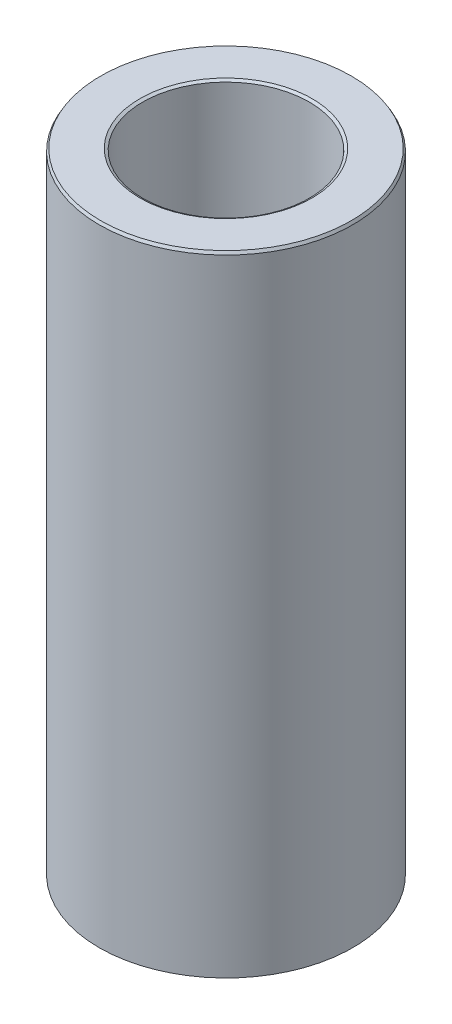
ISO-10303-21;
HEADER;
FILE_DESCRIPTION(('STEP AP214'),'2;1');
FILE_NAME('part.step','',(''),(''),'','','');
FILE_SCHEMA(('AUTOMOTIVE_DESIGN { 1 0 10303 214 1 1 1 1 }'));
ENDSEC;
DATA;
#1=APPLICATION_CONTEXT('core data for automotive mechanical design processes');
#2=APPLICATION_PROTOCOL_DEFINITION('international standard','automotive_design',2000,#1);
#3=PRODUCT_CONTEXT('',#1,'mechanical');
#4=PRODUCT('Part','Part','',(#3));
#5=PRODUCT_RELATED_PRODUCT_CATEGORY('part','',(#4));
#6=PRODUCT_DEFINITION_FORMATION('','',#4);
#7=PRODUCT_DEFINITION_CONTEXT('part definition',#1,'design');
#8=PRODUCT_DEFINITION('design','',#6,#7);
#9=PRODUCT_DEFINITION_SHAPE('','',#8);
#10=(LENGTH_UNIT() NAMED_UNIT(*) SI_UNIT(.MILLI.,.METRE.));
#11=(NAMED_UNIT(*) PLANE_ANGLE_UNIT() SI_UNIT($,.RADIAN.));
#12=(NAMED_UNIT(*) SI_UNIT($,.STERADIAN.) SOLID_ANGLE_UNIT());
#13=UNCERTAINTY_MEASURE_WITH_UNIT(LENGTH_MEASURE(1.E-05),#10,'distance_accuracy_value','');
#14=(GEOMETRIC_REPRESENTATION_CONTEXT(3) GLOBAL_UNCERTAINTY_ASSIGNED_CONTEXT((#13)) GLOBAL_UNIT_ASSIGNED_CONTEXT((#10,
#11,#12)) REPRESENTATION_CONTEXT('',''));
#15=CARTESIAN_POINT('',(0.,0.,0.));
#16=DIRECTION('',(0.,0.,1.));
#17=DIRECTION('',(1.,0.,0.));
#18=AXIS2_PLACEMENT_3D('',#15,#16,#17);
#19=CARTESIAN_POINT('',(0.,74.5081177382595,0.));
#20=DIRECTION('',(0.,-1.,0.));
#21=DIRECTION('',(0.,0.,-1.));
#22=AXIS2_PLACEMENT_3D('',#19,#20,#21);
#23=CYLINDRICAL_SURFACE('',#22,15.);
#24=CARTESIAN_POINT('',(0.,0.187076625269136,0.));
#25=DIRECTION('',(0.,1.,0.));
#26=DIRECTION('',(0.,0.,1.));
#27=AXIS2_PLACEMENT_3D('',#24,#25,#26);
#28=CIRCLE('',#27,15.);
#29=CARTESIAN_POINT('',(0.,0.187076625269136,15.));
#30=VERTEX_POINT('',#29);
#31=EDGE_CURVE('E10',#30,#30,#28,.T.);
#32=ORIENTED_EDGE('',*,*,#31,.T.);
#33=EDGE_LOOP('',(#32));
#34=FACE_BOUND('',#33,.T.);
#35=CARTESIAN_POINT('',(0.,74.1840915183848,0.));
#36=DIRECTION('',(0.,1.,0.));
#37=DIRECTION('',(0.,0.,1.));
#38=AXIS2_PLACEMENT_3D('',#35,#36,#37);
#39=CIRCLE('',#38,15.);
#40=CARTESIAN_POINT('',(0.,74.1840915183848,-15.));
#41=VERTEX_POINT('',#40);
#42=EDGE_CURVE('E50',#41,#41,#39,.F.);
#43=ORIENTED_EDGE('',*,*,#42,.T.);
#44=EDGE_LOOP('',(#43));
#45=FACE_BOUND('',#44,.T.);
#46=ADVANCED_FACE('F39',(#34,#45),#23,.T.);
#47=CARTESIAN_POINT('',(0.,74.5081177382595,0.));
#48=DIRECTION('',(0.,1.,0.));
#49=DIRECTION('',(0.,0.,1.));
#50=AXIS2_PLACEMENT_3D('',#47,#48,#49);
#51=PLANE('',#50);
#52=CARTESIAN_POINT('',(0.,74.5081177382595,0.));
#53=DIRECTION('',(0.,1.,0.));
#54=DIRECTION('',(0.,0.,1.));
#55=AXIS2_PLACEMENT_3D('',#52,#53,#54);
#56=CIRCLE('',#55,10.1763425456597);
#57=CARTESIAN_POINT('',(0.,74.5081177382595,10.1763425456597));
#58=VERTEX_POINT('',#57);
#59=EDGE_CURVE('E58',#58,#58,#56,.F.);
#60=ORIENTED_EDGE('',*,*,#59,.T.);
#61=EDGE_LOOP('',(#60));
#62=FACE_BOUND('',#61,.T.);
#63=CARTESIAN_POINT('',(0.,74.5081177382595,0.));
#64=DIRECTION('',(0.,1.,0.));
#65=DIRECTION('',(0.,0.,1.));
#66=AXIS2_PLACEMENT_3D('',#63,#64,#65);
#67=CIRCLE('',#66,14.8129233747309);
#68=CARTESIAN_POINT('',(0.,74.5081177382595,-14.8129233747309));
#69=VERTEX_POINT('',#68);
#70=EDGE_CURVE('E61',#69,#69,#67,.T.);
#71=ORIENTED_EDGE('',*,*,#70,.T.);
#72=EDGE_LOOP('',(#71));
#73=FACE_BOUND('',#72,.T.);
#74=ADVANCED_FACE('F88',(#62,#73),#51,.T.);
#75=CARTESIAN_POINT('',(0.,0.,0.));
#76=DIRECTION('',(0.,1.,0.));
#77=DIRECTION('',(0.,0.,1.));
#78=AXIS2_PLACEMENT_3D('',#75,#76,#77);
#79=PLANE('',#78);
#80=CARTESIAN_POINT('',(0.,0.,0.));
#81=DIRECTION('',(0.,1.,0.));
#82=DIRECTION('',(0.,0.,1.));
#83=AXIS2_PLACEMENT_3D('',#80,#81,#82);
#84=CIRCLE('',#83,10.0393929510542);
#85=CARTESIAN_POINT('',(0.,0.,10.0393929510542));
#86=VERTEX_POINT('',#85);
#87=EDGE_CURVE('E51',#86,#86,#84,.T.);
#88=ORIENTED_EDGE('',*,*,#87,.T.);
#89=EDGE_LOOP('',(#88));
#90=FACE_BOUND('',#89,.T.);
#91=CARTESIAN_POINT('',(0.,0.,0.));
#92=DIRECTION('',(0.,1.,0.));
#93=DIRECTION('',(0.,0.,1.));
#94=AXIS2_PLACEMENT_3D('',#91,#92,#93);
#95=CIRCLE('',#94,14.6759737801253);
#96=CARTESIAN_POINT('',(0.,0.,14.6759737801253));
#97=VERTEX_POINT('',#96);
#98=EDGE_CURVE('E54',#97,#97,#95,.F.);
#99=ORIENTED_EDGE('',*,*,#98,.T.);
#100=EDGE_LOOP('',(#99));
#101=FACE_BOUND('',#100,.T.);
#102=ADVANCED_FACE('F83',(#90,#101),#79,.F.);
#103=CARTESIAN_POINT('',(0.,74.5081177382595,0.));
#104=DIRECTION('',(0.,-1.,0.));
#105=DIRECTION('',(0.,0.,-1.));
#106=AXIS2_PLACEMENT_3D('',#103,#104,#105);
#107=CYLINDRICAL_SURFACE('',#106,9.85231632578505);
#108=CARTESIAN_POINT('',(0.,74.3210411129904,0.));
#109=DIRECTION('',(0.,1.,0.));
#110=DIRECTION('',(0.,0.,1.));
#111=AXIS2_PLACEMENT_3D('',#108,#109,#110);
#112=CIRCLE('',#111,9.85231632578505);
#113=CARTESIAN_POINT('',(0.,74.3210411129904,9.85231632578505));
#114=VERTEX_POINT('',#113);
#115=EDGE_CURVE('E67',#114,#114,#112,.T.);
#116=ORIENTED_EDGE('',*,*,#115,.T.);
#117=EDGE_LOOP('',(#116));
#118=FACE_BOUND('',#117,.T.);
#119=CARTESIAN_POINT('',(0.,0.324026219874665,0.));
#120=DIRECTION('',(0.,1.,0.));
#121=DIRECTION('',(0.,0.,1.));
#122=AXIS2_PLACEMENT_3D('',#119,#120,#121);
#123=CIRCLE('',#122,9.85231632578505);
#124=CARTESIAN_POINT('',(0.,0.324026219874665,9.85231632578505));
#125=VERTEX_POINT('',#124);
#126=EDGE_CURVE('E69',#125,#125,#123,.F.);
#127=ORIENTED_EDGE('',*,*,#126,.T.);
#128=EDGE_LOOP('',(#127));
#129=FACE_BOUND('',#128,.T.);
#130=ADVANCED_FACE('F71',(#118,#129),#107,.F.);
#131=CARTESIAN_POINT('',(0.,74.3210411129904,0.));
#132=DIRECTION('',(0.,1.,0.));
#133=DIRECTION('',(0.,0.,1.));
#134=AXIS2_PLACEMENT_3D('',#131,#132,#133);
#135=CONICAL_SURFACE('',#134,9.85231632578505,1.04719755119661);
#136=ORIENTED_EDGE('',*,*,#59,.F.);
#137=EDGE_LOOP('',(#136));
#138=FACE_BOUND('',#137,.T.);
#139=ORIENTED_EDGE('',*,*,#115,.F.);
#140=EDGE_LOOP('',(#139));
#141=FACE_BOUND('',#140,.T.);
#142=ADVANCED_FACE('F77',(#138,#141),#135,.F.);
#143=CARTESIAN_POINT('',(0.,0.,0.));
#144=DIRECTION('',(0.,-1.,0.));
#145=DIRECTION('',(0.,0.,-1.));
#146=AXIS2_PLACEMENT_3D('',#143,#144,#145);
#147=CONICAL_SURFACE('',#146,10.0393929510542,0.523598775598286);
#148=ORIENTED_EDGE('',*,*,#126,.F.);
#149=EDGE_LOOP('',(#148));
#150=FACE_BOUND('',#149,.T.);
#151=ORIENTED_EDGE('',*,*,#87,.F.);
#152=EDGE_LOOP('',(#151));
#153=FACE_BOUND('',#152,.T.);
#154=ADVANCED_FACE('F73',(#150,#153),#147,.F.);
#155=CARTESIAN_POINT('',(0.,0.187076625269136,0.));
#156=DIRECTION('',(0.,1.,0.));
#157=DIRECTION('',(0.,0.,1.));
#158=AXIS2_PLACEMENT_3D('',#155,#156,#157);
#159=CONICAL_SURFACE('',#158,15.,1.04719755119658);
#160=ORIENTED_EDGE('',*,*,#98,.F.);
#161=EDGE_LOOP('',(#160));
#162=FACE_BOUND('',#161,.T.);
#163=ORIENTED_EDGE('',*,*,#31,.F.);
#164=EDGE_LOOP('',(#163));
#165=FACE_BOUND('',#164,.T.);
#166=ADVANCED_FACE('F76',(#162,#165),#159,.T.);
#167=CARTESIAN_POINT('',(0.,74.5081177382595,0.));
#168=DIRECTION('',(0.,-1.,0.));
#169=DIRECTION('',(0.,0.,-1.));
#170=AXIS2_PLACEMENT_3D('',#167,#168,#169);
#171=CONICAL_SURFACE('',#170,14.8129233747309,0.523598775598284);
#172=CARTESIAN_POINT('',(0.,74.1840915183848,-15.));
#173=CARTESIAN_POINT('',(0.,74.1874667915085,-14.9980512851534));
#174=CARTESIAN_POINT('',(0.,74.1908420646322,-14.9961025703069));
#175=CARTESIAN_POINT('',(0.,74.1975926108796,-14.9922051406138));
#176=CARTESIAN_POINT('',(0.,74.2009678840033,-14.9902564257672));
#177=CARTESIAN_POINT('',(0.,74.2077184302507,-14.9863589960741));
#178=CARTESIAN_POINT('',(0.,74.2110937033744,-14.9844102812276));
#179=CARTESIAN_POINT('',(0.,74.2178442496217,-14.9805128515345));
#180=CARTESIAN_POINT('',(0.,74.2212195227454,-14.9785641366879));
#181=CARTESIAN_POINT('',(0.,74.2279700689928,-14.9746667069948));
#182=CARTESIAN_POINT('',(0.,74.2313453421165,-14.9727179921483));
#183=CARTESIAN_POINT('',(0.,74.2380958883639,-14.9688205624551));
#184=CARTESIAN_POINT('',(0.,74.2414711614876,-14.9668718476086));
#185=CARTESIAN_POINT('',(0.,74.248221707735,-14.9629744179155));
#186=CARTESIAN_POINT('',(0.,74.2515969808587,-14.9610257030689));
#187=CARTESIAN_POINT('',(0.,74.2583475271061,-14.9571282733758));
#188=CARTESIAN_POINT('',(0.,74.2617228002298,-14.9551795585293));
#189=CARTESIAN_POINT('',(0.,74.2684733464772,-14.9512821288362));
#190=CARTESIAN_POINT('',(0.,74.2718486196009,-14.9493334139896));
#191=CARTESIAN_POINT('',(0.,74.2785991658482,-14.9454359842965));
#192=CARTESIAN_POINT('',(0.,74.281974438972,-14.94348726945));
#193=CARTESIAN_POINT('',(0.,74.2887249852193,-14.9395898397568));
#194=CARTESIAN_POINT('',(0.,74.292100258343,-14.9376411249103));
#195=CARTESIAN_POINT('',(0.,74.2988508045904,-14.9337436952172));
#196=CARTESIAN_POINT('',(0.,74.3022260777141,-14.9317949803706));
#197=CARTESIAN_POINT('',(0.,74.3089766239615,-14.9278975506775));
#198=CARTESIAN_POINT('',(0.,74.3123518970852,-14.925948835831));
#199=CARTESIAN_POINT('',(0.,74.3191024433326,-14.9220514061379));
#200=CARTESIAN_POINT('',(0.,74.3224777164563,-14.9201026912913));
#201=CARTESIAN_POINT('',(0.,74.3292282627037,-14.9162052615982));
#202=CARTESIAN_POINT('',(0.,74.3326035358274,-14.9142565467517));
#203=CARTESIAN_POINT('',(0.,74.3393540820748,-14.9103591170585));
#204=CARTESIAN_POINT('',(0.,74.3427293551984,-14.908410402212));
#205=CARTESIAN_POINT('',(0.,74.3494799014458,-14.9045129725189));
#206=CARTESIAN_POINT('',(0.,74.3528551745695,-14.9025642576723));
#207=CARTESIAN_POINT('',(0.,74.3596057208169,-14.8986668279792));
#208=CARTESIAN_POINT('',(0.,74.3629809939406,-14.8967181131327));
#209=CARTESIAN_POINT('',(0.,74.369731540188,-14.8928206834396));
#210=CARTESIAN_POINT('',(0.,74.3731068133117,-14.890871968593));
#211=CARTESIAN_POINT('',(0.,74.3798573595591,-14.8869745388999));
#212=CARTESIAN_POINT('',(0.,74.3832326326828,-14.8850258240533));
#213=CARTESIAN_POINT('',(0.,74.3899831789302,-14.8811283943602));
#214=CARTESIAN_POINT('',(0.,74.3933584520539,-14.8791796795137));
#215=CARTESIAN_POINT('',(0.,74.4001089983012,-14.8752822498206));
#216=CARTESIAN_POINT('',(0.,74.403484271425,-14.873333534974));
#217=CARTESIAN_POINT('',(0.,74.4102348176723,-14.8694361052809));
#218=CARTESIAN_POINT('',(0.,74.413610090796,-14.8674873904344));
#219=CARTESIAN_POINT('',(0.,74.4203606370434,-14.8635899607413));
#220=CARTESIAN_POINT('',(0.,74.4237359101671,-14.8616412458947));
#221=CARTESIAN_POINT('',(0.,74.4304864564145,-14.8577438162016));
#222=CARTESIAN_POINT('',(0.,74.4338617295382,-14.855795101355));
#223=CARTESIAN_POINT('',(0.,74.4406122757856,-14.8518976716619));
#224=CARTESIAN_POINT('',(0.,74.4439875489093,-14.8499489568154));
#225=CARTESIAN_POINT('',(0.,74.4507380951567,-14.8460515271223));
#226=CARTESIAN_POINT('',(0.,74.4541133682804,-14.8441028122757));
#227=CARTESIAN_POINT('',(0.,74.4608639145278,-14.8402053825826));
#228=CARTESIAN_POINT('',(0.,74.4642391876515,-14.8382566677361));
#229=CARTESIAN_POINT('',(0.,74.4709897338988,-14.834359238043));
#230=CARTESIAN_POINT('',(0.,74.4743650070226,-14.8324105231964));
#231=CARTESIAN_POINT('',(0.,74.4811155532699,-14.8285130935033));
#232=CARTESIAN_POINT('',(0.,74.4844908263936,-14.8265643786567));
#233=CARTESIAN_POINT('',(0.,74.491241372641,-14.8226669489636));
#234=CARTESIAN_POINT('',(0.,74.4946166457647,-14.8207182341171));
#235=CARTESIAN_POINT('',(0.,74.5013671920121,-14.816820804424));
#236=CARTESIAN_POINT('',(0.,74.5047424651358,-14.8148720895774));
#237=CARTESIAN_POINT('',(0.,74.5081177382595,-14.8129233747309));
#238=B_SPLINE_CURVE_WITH_KNOTS('',3,(#172,#173,#174,#175,#176,#177,#178,#179,#180,#181,#182,
#183,#184,#185,#186,#187,#188,#189,#190,#191,#192,#193,#194,#195,#196,#197,#198,#199,#200,#201,
#202,#203,#204,#205,#206,#207,#208,#209,#210,#211,#212,#213,#214,#215,#216,#217,#218,#219,#220,
#221,#222,#223,#224,#225,#226,#227,#228,#229,#230,#231,#232,#233,#234,#235,#236,#237),
.UNSPECIFIED.,.F.,.F.,(4,2,2,2,2,2,2,2,2,2,2,2,2,2,2,2,2,2,2,2,2,2,2,2,2,2,2,2,2,2,2,2,4),(0.,
0.0116922890793219,0.0233845781586437,0.0350768672379656,0.0467691563172883,0.0584614453966102,
0.070153734475932,0.0818460235552539,0.0935383126345766,0.105230601713898,0.11692289079322,
0.128615179872542,0.140307468951865,0.151999758031187,0.163692047110509,0.175384336189831,
0.187076625269141,0.198768914348463,0.210461203427785,0.222153492507107,0.23384578158643,
0.245538070665751,0.257230359745073,0.268922648824395,0.280614937903718,0.29230722698304,
0.303999516062361,0.315691805141683,0.327384094221006,0.339076383300328,0.35076867237965,
0.362460961458971,0.374153250538294),.UNSPECIFIED.);
#239=EDGE_CURVE('BSEAM45',#41,#69,#238,.T.);
#240=ORIENTED_EDGE('',*,*,#42,.F.);
#241=ORIENTED_EDGE('',*,*,#70,.F.);
#242=ORIENTED_EDGE('',*,*,#239,.T.);
#243=ORIENTED_EDGE('',*,*,#239,.F.);
#244=EDGE_LOOP('',(#240,#242,#241,#243));
#245=FACE_BOUND('',#244,.T.);
#246=ADVANCED_FACE('F45',(#245),#171,.T.);
#247=CLOSED_SHELL('',(#46,#74,#102,#130,#142,#154,#166,#246));
#248=MANIFOLD_SOLID_BREP('B2',#247);
#249=ADVANCED_BREP_SHAPE_REPRESENTATION('',(#18,#248),#14);
#250=SHAPE_DEFINITION_REPRESENTATION(#9,#249);
ENDSEC;
END-ISO-10303-21;
